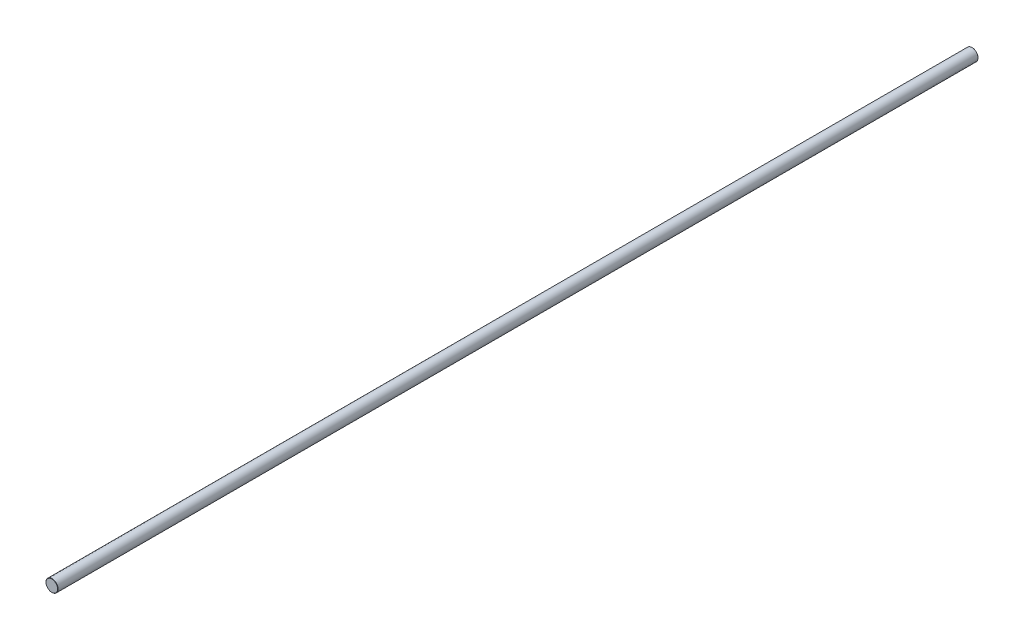
ISO-10303-21;
HEADER;
FILE_DESCRIPTION(('STEP AP214'),'2;1');
FILE_NAME('part.step','',(''),(''),'','','');
FILE_SCHEMA(('AUTOMOTIVE_DESIGN { 1 0 10303 214 1 1 1 1 }'));
ENDSEC;
DATA;
#1=APPLICATION_CONTEXT('core data for automotive mechanical design processes');
#2=APPLICATION_PROTOCOL_DEFINITION('international standard','automotive_design',2000,#1);
#3=PRODUCT_CONTEXT('',#1,'mechanical');
#4=PRODUCT('Part','Part','',(#3));
#5=PRODUCT_RELATED_PRODUCT_CATEGORY('part','',(#4));
#6=PRODUCT_DEFINITION_FORMATION('','',#4);
#7=PRODUCT_DEFINITION_CONTEXT('part definition',#1,'design');
#8=PRODUCT_DEFINITION('design','',#6,#7);
#9=PRODUCT_DEFINITION_SHAPE('','',#8);
#10=(LENGTH_UNIT() NAMED_UNIT(*) SI_UNIT(.MILLI.,.METRE.));
#11=(NAMED_UNIT(*) PLANE_ANGLE_UNIT() SI_UNIT($,.RADIAN.));
#12=(NAMED_UNIT(*) SI_UNIT($,.STERADIAN.) SOLID_ANGLE_UNIT());
#13=UNCERTAINTY_MEASURE_WITH_UNIT(LENGTH_MEASURE(1.E-05),#10,'distance_accuracy_value','');
#14=(GEOMETRIC_REPRESENTATION_CONTEXT(3) GLOBAL_UNCERTAINTY_ASSIGNED_CONTEXT((#13)) GLOBAL_UNIT_ASSIGNED_CONTEXT((#10,
#11,#12)) REPRESENTATION_CONTEXT('',''));
#15=CARTESIAN_POINT('',(0.,0.,0.));
#16=DIRECTION('',(0.,0.,1.));
#17=DIRECTION('',(1.,0.,0.));
#18=AXIS2_PLACEMENT_3D('',#15,#16,#17);
#19=CARTESIAN_POINT('',(0.,0.,610.));
#20=DIRECTION('',(0.,0.,-1.));
#21=DIRECTION('',(-1.,0.,0.));
#22=AXIS2_PLACEMENT_3D('',#19,#20,#21);
#23=CYLINDRICAL_SURFACE('',#22,8.);
#24=CARTESIAN_POINT('',(0.,0.,-609.68));
#25=DIRECTION('',(0.,0.,1.));
#26=DIRECTION('',(1.,0.,0.));
#27=AXIS2_PLACEMENT_3D('',#24,#25,#26);
#28=CIRCLE('',#27,8.);
#29=CARTESIAN_POINT('',(8.,0.,-609.68));
#30=VERTEX_POINT('',#29);
#31=EDGE_CURVE('E56',#30,#30,#28,.T.);
#32=ORIENTED_EDGE('',*,*,#31,.T.);
#33=EDGE_LOOP('',(#32));
#34=FACE_BOUND('',#33,.T.);
#35=CARTESIAN_POINT('',(0.,0.,609.68));
#36=DIRECTION('',(0.,0.,1.));
#37=DIRECTION('',(1.,0.,0.));
#38=AXIS2_PLACEMENT_3D('',#35,#36,#37);
#39=CIRCLE('',#38,8.);
#40=CARTESIAN_POINT('',(8.,0.,609.68));
#41=VERTEX_POINT('',#40);
#42=EDGE_CURVE('E61',#41,#41,#39,.F.);
#43=ORIENTED_EDGE('',*,*,#42,.T.);
#44=EDGE_LOOP('',(#43));
#45=FACE_BOUND('',#44,.T.);
#46=ADVANCED_FACE('F43',(#34,#45),#23,.T.);
#47=CARTESIAN_POINT('',(0.,0.,610.));
#48=DIRECTION('',(0.,0.,1.));
#49=DIRECTION('',(1.,0.,0.));
#50=AXIS2_PLACEMENT_3D('',#47,#48,#49);
#51=PLANE('',#50);
#52=CARTESIAN_POINT('',(0.,0.,610.));
#53=DIRECTION('',(0.,0.,1.));
#54=DIRECTION('',(1.,0.,0.));
#55=AXIS2_PLACEMENT_3D('',#52,#53,#54);
#56=CIRCLE('',#55,7.6799999999998);
#57=CARTESIAN_POINT('',(7.6799999999998,0.,610.));
#58=VERTEX_POINT('',#57);
#59=EDGE_CURVE('E10',#58,#58,#56,.T.);
#60=ORIENTED_EDGE('',*,*,#59,.T.);
#61=EDGE_LOOP('',(#60));
#62=FACE_BOUND('',#61,.T.);
#63=ADVANCED_FACE('F78',(#62),#51,.T.);
#64=CARTESIAN_POINT('',(0.,0.,-610.));
#65=DIRECTION('',(0.,0.,1.));
#66=DIRECTION('',(1.,0.,0.));
#67=AXIS2_PLACEMENT_3D('',#64,#65,#66);
#68=PLANE('',#67);
#69=CARTESIAN_POINT('',(0.,0.,-610.));
#70=DIRECTION('',(0.,0.,1.));
#71=DIRECTION('',(1.,0.,0.));
#72=AXIS2_PLACEMENT_3D('',#69,#70,#71);
#73=CIRCLE('',#72,7.68000000000002);
#74=CARTESIAN_POINT('',(7.68000000000002,0.,-610.));
#75=VERTEX_POINT('',#74);
#76=EDGE_CURVE('E51',#75,#75,#73,.F.);
#77=ORIENTED_EDGE('',*,*,#76,.T.);
#78=EDGE_LOOP('',(#77));
#79=FACE_BOUND('',#78,.T.);
#80=ADVANCED_FACE('F75',(#79),#68,.F.);
#81=CARTESIAN_POINT('',(0.,0.,-609.68));
#82=DIRECTION('',(0.,0.,1.));
#83=DIRECTION('',(1.,0.,0.));
#84=AXIS2_PLACEMENT_3D('',#81,#82,#83);
#85=CONICAL_SURFACE('',#84,8.,0.785398163397264);
#86=ORIENTED_EDGE('',*,*,#76,.F.);
#87=EDGE_LOOP('',(#86));
#88=FACE_BOUND('',#87,.T.);
#89=ORIENTED_EDGE('',*,*,#31,.F.);
#90=EDGE_LOOP('',(#89));
#91=FACE_BOUND('',#90,.T.);
#92=ADVANCED_FACE('F71',(#88,#91),#85,.T.);
#93=CARTESIAN_POINT('',(0.,0.,610.));
#94=DIRECTION('',(0.,0.,-1.));
#95=DIRECTION('',(-1.,0.,0.));
#96=AXIS2_PLACEMENT_3D('',#93,#94,#95);
#97=CONICAL_SURFACE('',#96,7.6799999999998,0.785398163397438);
#98=ORIENTED_EDGE('',*,*,#42,.F.);
#99=EDGE_LOOP('',(#98));
#100=FACE_BOUND('',#99,.T.);
#101=ORIENTED_EDGE('',*,*,#59,.F.);
#102=EDGE_LOOP('',(#101));
#103=FACE_BOUND('',#102,.T.);
#104=ADVANCED_FACE('F45',(#100,#103),#97,.T.);
#105=CLOSED_SHELL('',(#46,#63,#80,#92,#104));
#106=MANIFOLD_SOLID_BREP('B2',#105);
#107=ADVANCED_BREP_SHAPE_REPRESENTATION('',(#18,#106),#14);
#108=SHAPE_DEFINITION_REPRESENTATION(#9,#107);
ENDSEC;
END-ISO-10303-21;
